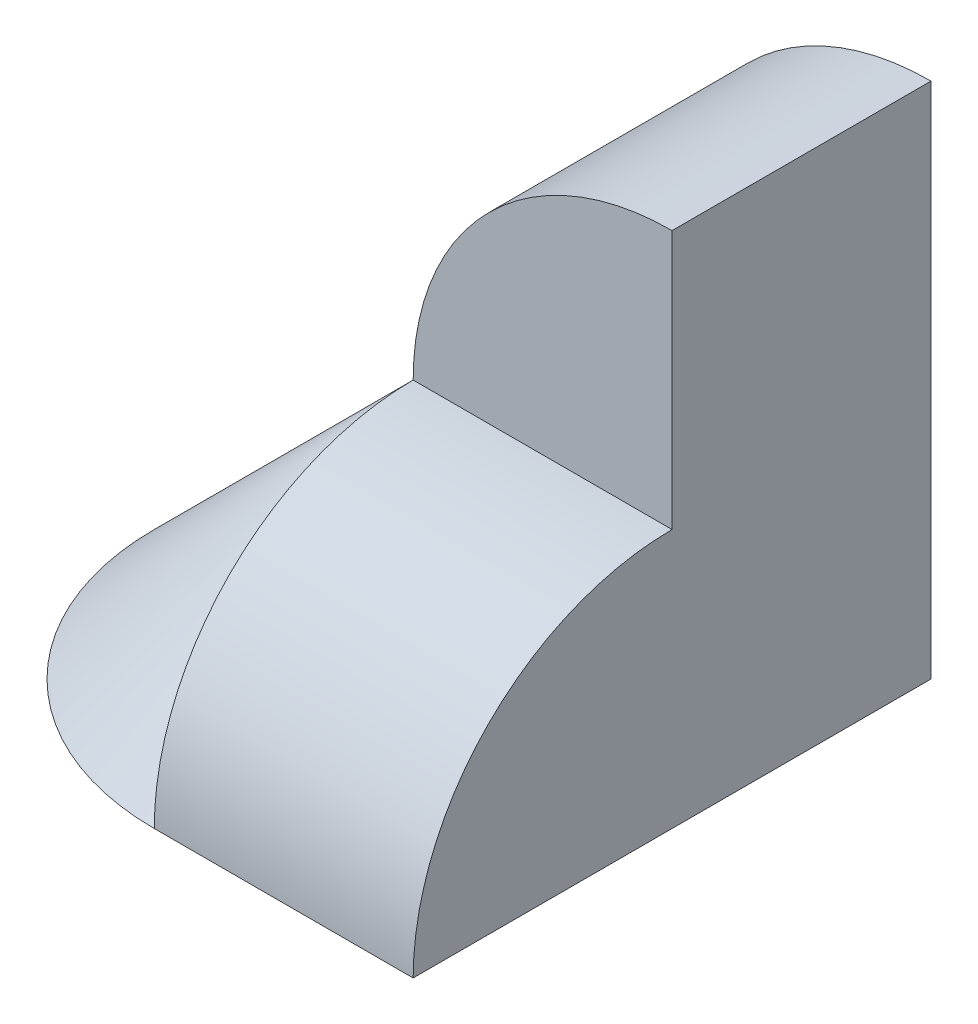
ISO-10303-21;
HEADER;
FILE_DESCRIPTION(('STEP AP214'),'2;1');
FILE_NAME('part.step','',(''),(''),'','','');
FILE_SCHEMA(('AUTOMOTIVE_DESIGN { 1 0 10303 214 1 1 1 1 }'));
ENDSEC;
DATA;
#1=APPLICATION_CONTEXT('core data for automotive mechanical design processes');
#2=APPLICATION_PROTOCOL_DEFINITION('international standard','automotive_design',2000,#1);
#3=PRODUCT_CONTEXT('',#1,'mechanical');
#4=PRODUCT('Part','Part','',(#3));
#5=PRODUCT_RELATED_PRODUCT_CATEGORY('part','',(#4));
#6=PRODUCT_DEFINITION_FORMATION('','',#4);
#7=PRODUCT_DEFINITION_CONTEXT('part definition',#1,'design');
#8=PRODUCT_DEFINITION('design','',#6,#7);
#9=PRODUCT_DEFINITION_SHAPE('','',#8);
#10=(LENGTH_UNIT() NAMED_UNIT(*) SI_UNIT(.MILLI.,.METRE.));
#11=(NAMED_UNIT(*) PLANE_ANGLE_UNIT() SI_UNIT($,.RADIAN.));
#12=(NAMED_UNIT(*) SI_UNIT($,.STERADIAN.) SOLID_ANGLE_UNIT());
#13=UNCERTAINTY_MEASURE_WITH_UNIT(LENGTH_MEASURE(1.E-05),#10,'distance_accuracy_value','');
#14=(GEOMETRIC_REPRESENTATION_CONTEXT(3) GLOBAL_UNCERTAINTY_ASSIGNED_CONTEXT((#13)) GLOBAL_UNIT_ASSIGNED_CONTEXT((#10,
#11,#12)) REPRESENTATION_CONTEXT('',''));
#15=CARTESIAN_POINT('',(0.,0.,0.));
#16=DIRECTION('',(0.,0.,1.));
#17=DIRECTION('',(1.,0.,0.));
#18=AXIS2_PLACEMENT_3D('',#15,#16,#17);
#19=CARTESIAN_POINT('',(0.,0.,2.));
#20=DIRECTION('',(1.,0.,0.));
#21=DIRECTION('',(0.,0.,-1.));
#22=AXIS2_PLACEMENT_3D('',#19,#20,#21);
#23=PLANE('',#22);
#24=DIRECTION('',(0.,0.707106781186548,-0.707106781186548));
#25=VECTOR('',#24,1.);
#26=CARTESIAN_POINT('',(0.,2.,2.));
#27=LINE('',#26,#25);
#28=CARTESIAN_POINT('',(0.,0.,4.));
#29=VERTEX_POINT('',#28);
#30=CARTESIAN_POINT('',(0.,2.,2.));
#31=VERTEX_POINT('',#30);
#32=EDGE_CURVE('E109',#29,#31,#27,.T.);
#33=ORIENTED_EDGE('',*,*,#32,.F.);
#34=CARTESIAN_POINT('',(0.,0.,1.99999999999999));
#35=DIRECTION('',(1.,0.,0.));
#36=DIRECTION('',(0.,0.,-1.));
#37=AXIS2_PLACEMENT_3D('',#34,#35,#36);
#38=CIRCLE('',#37,2.00000000000001);
#39=EDGE_CURVE('E116',#31,#29,#38,.T.);
#40=ORIENTED_EDGE('',*,*,#39,.F.);
#41=EDGE_LOOP('',(#33,#40));
#42=FACE_BOUND('',#41,.T.);
#43=ADVANCED_FACE('F33',(#42),#23,.F.);
#44=DIRECTION('',(0.,0.,-1.));
#45=VECTOR('',#44,1.);
#46=CARTESIAN_POINT('',(0.,0.,2.));
#47=LINE('',#46,#45);
#48=CARTESIAN_POINT('',(0.,0.,0.999999999999997));
#49=VERTEX_POINT('',#48);
#50=CARTESIAN_POINT('',(0.,0.,0.));
#51=VERTEX_POINT('',#50);
#52=EDGE_CURVE('E41',#49,#51,#47,.T.);
#53=ORIENTED_EDGE('',*,*,#52,.F.);
#54=DIRECTION('',(0.,-1.,0.));
#55=VECTOR('',#54,1.);
#56=CARTESIAN_POINT('',(0.,2.,1.));
#57=LINE('',#56,#55);
#58=CARTESIAN_POINT('',(0.,2.,1.));
#59=VERTEX_POINT('',#58);
#60=EDGE_CURVE('E51',#59,#49,#57,.T.);
#61=ORIENTED_EDGE('',*,*,#60,.F.);
#62=DIRECTION('',(0.,0.,1.));
#63=VECTOR('',#62,1.);
#64=CARTESIAN_POINT('',(0.,2.,-2.));
#65=LINE('',#64,#63);
#66=CARTESIAN_POINT('',(0.,2.,0.));
#67=VERTEX_POINT('',#66);
#68=EDGE_CURVE('E130',#67,#59,#65,.T.);
#69=ORIENTED_EDGE('',*,*,#68,.F.);
#70=DIRECTION('',(0.,-1.,0.));
#71=VECTOR('',#70,1.);
#72=CARTESIAN_POINT('',(0.,0.,0.));
#73=LINE('',#72,#71);
#74=EDGE_CURVE('E132',#67,#51,#73,.T.);
#75=ORIENTED_EDGE('',*,*,#74,.T.);
#76=EDGE_LOOP('',(#53,#61,#69,#75));
#77=FACE_BOUND('',#76,.T.);
#78=ADVANCED_FACE('F35',(#77),#23,.F.);
#79=CARTESIAN_POINT('',(0.,0.,2.));
#80=DIRECTION('',(0.,1.,0.));
#81=DIRECTION('',(0.,0.,1.));
#82=AXIS2_PLACEMENT_3D('',#79,#80,#81);
#83=PLANE('',#82);
#84=DIRECTION('',(-1.,0.,0.));
#85=VECTOR('',#84,1.);
#86=CARTESIAN_POINT('',(0.,0.,1.));
#87=LINE('',#86,#85);
#88=CARTESIAN_POINT('',(-2.,0.,0.999999999999993));
#89=VERTEX_POINT('',#88);
#90=EDGE_CURVE('E86',#49,#89,#87,.T.);
#91=ORIENTED_EDGE('',*,*,#90,.F.);
#92=ORIENTED_EDGE('',*,*,#52,.T.);
#93=DIRECTION('',(1.,0.,0.));
#94=VECTOR('',#93,1.);
#95=CARTESIAN_POINT('',(0.,0.,0.));
#96=LINE('',#95,#94);
#97=CARTESIAN_POINT('',(2.,0.,0.));
#98=VERTEX_POINT('',#97);
#99=EDGE_CURVE('E138',#51,#98,#96,.T.);
#100=ORIENTED_EDGE('',*,*,#99,.T.);
#101=DIRECTION('',(0.,0.,-1.));
#102=VECTOR('',#101,1.);
#103=CARTESIAN_POINT('',(2.,0.,2.));
#104=LINE('',#103,#102);
#105=CARTESIAN_POINT('',(2.,0.,4.));
#106=VERTEX_POINT('',#105);
#107=EDGE_CURVE('E143',#106,#98,#104,.T.);
#108=ORIENTED_EDGE('',*,*,#107,.F.);
#109=DIRECTION('',(1.,0.,0.));
#110=VECTOR('',#109,1.);
#111=CARTESIAN_POINT('',(0.,0.,4.));
#112=LINE('',#111,#110);
#113=EDGE_CURVE('E119',#29,#106,#112,.T.);
#114=ORIENTED_EDGE('',*,*,#113,.F.);
#115=CARTESIAN_POINT('',(0.,0.,2.));
#116=DIRECTION('',(0.,1.,0.));
#117=DIRECTION('',(0.,0.,1.));
#118=AXIS2_PLACEMENT_3D('',#115,#116,#117);
#119=CIRCLE('',#118,2.);
#120=CARTESIAN_POINT('',(-2.,0.,1.99999999999999));
#121=VERTEX_POINT('',#120);
#122=EDGE_CURVE('E99',#121,#29,#119,.T.);
#123=ORIENTED_EDGE('',*,*,#122,.F.);
#124=DIRECTION('',(0.,0.,1.));
#125=VECTOR('',#124,1.);
#126=CARTESIAN_POINT('',(-2.,0.,0.999999999999993));
#127=LINE('',#126,#125);
#128=EDGE_CURVE('E93',#89,#121,#127,.T.);
#129=ORIENTED_EDGE('',*,*,#128,.F.);
#130=EDGE_LOOP('',(#91,#92,#100,#108,#114,#123,#129));
#131=FACE_BOUND('',#130,.T.);
#132=ADVANCED_FACE('F97',(#131),#83,.F.);
#133=CARTESIAN_POINT('',(2.,0.,2.));
#134=DIRECTION('',(-1.,0.,0.));
#135=DIRECTION('',(0.,0.,1.));
#136=AXIS2_PLACEMENT_3D('',#133,#134,#135);
#137=PLANE('',#136);
#138=DIRECTION('',(0.,1.,0.));
#139=VECTOR('',#138,1.);
#140=CARTESIAN_POINT('',(2.,0.,0.));
#141=LINE('',#140,#139);
#142=CARTESIAN_POINT('',(2.,4.,0.));
#143=VERTEX_POINT('',#142);
#144=EDGE_CURVE('E136',#98,#143,#141,.T.);
#145=ORIENTED_EDGE('',*,*,#144,.T.);
#146=DIRECTION('',(0.,0.,-1.));
#147=VECTOR('',#146,1.);
#148=CARTESIAN_POINT('',(2.,4.,2.));
#149=LINE('',#148,#147);
#150=CARTESIAN_POINT('',(2.,4.,2.));
#151=VERTEX_POINT('',#150);
#152=EDGE_CURVE('E135',#151,#143,#149,.T.);
#153=ORIENTED_EDGE('',*,*,#152,.F.);
#154=DIRECTION('',(0.,1.,0.));
#155=VECTOR('',#154,1.);
#156=CARTESIAN_POINT('',(2.,0.,2.));
#157=LINE('',#156,#155);
#158=CARTESIAN_POINT('',(2.,2.,2.));
#159=VERTEX_POINT('',#158);
#160=EDGE_CURVE('E133',#159,#151,#157,.T.);
#161=ORIENTED_EDGE('',*,*,#160,.F.);
#162=CARTESIAN_POINT('',(2.,0.,1.99999999999999));
#163=DIRECTION('',(1.,0.,0.));
#164=DIRECTION('',(0.,0.,-1.));
#165=AXIS2_PLACEMENT_3D('',#162,#163,#164);
#166=CIRCLE('',#165,2.00000000000001);
#167=EDGE_CURVE('E115',#159,#106,#166,.T.);
#168=ORIENTED_EDGE('',*,*,#167,.T.);
#169=ORIENTED_EDGE('',*,*,#107,.T.);
#170=EDGE_LOOP('',(#145,#153,#161,#168,#169));
#171=FACE_BOUND('',#170,.T.);
#172=ADVANCED_FACE('F153',(#171),#137,.F.);
#173=CARTESIAN_POINT('',(0.,0.,2.));
#174=DIRECTION('',(0.,0.,-1.));
#175=DIRECTION('',(-1.,0.,0.));
#176=AXIS2_PLACEMENT_3D('',#173,#174,#175);
#177=PLANE('',#176);
#178=CARTESIAN_POINT('',(2.,2.,2.));
#179=DIRECTION('',(0.,0.,-1.));
#180=DIRECTION('',(-1.,0.,0.));
#181=AXIS2_PLACEMENT_3D('',#178,#179,#180);
#182=CIRCLE('',#181,2.);
#183=EDGE_CURVE('E125',#31,#151,#182,.T.);
#184=ORIENTED_EDGE('',*,*,#183,.F.);
#185=DIRECTION('',(1.,0.,0.));
#186=VECTOR('',#185,1.);
#187=CARTESIAN_POINT('',(0.,2.,2.));
#188=LINE('',#187,#186);
#189=EDGE_CURVE('E122',#31,#159,#188,.T.);
#190=ORIENTED_EDGE('',*,*,#189,.T.);
#191=ORIENTED_EDGE('',*,*,#160,.T.);
#192=EDGE_LOOP('',(#184,#190,#191));
#193=FACE_BOUND('',#192,.T.);
#194=ADVANCED_FACE('F163',(#193),#177,.F.);
#195=CARTESIAN_POINT('',(0.,0.,0.));
#196=DIRECTION('',(0.,0.,-1.));
#197=DIRECTION('',(-1.,0.,0.));
#198=AXIS2_PLACEMENT_3D('',#195,#196,#197);
#199=PLANE('',#198);
#200=CARTESIAN_POINT('',(2.,2.,0.));
#201=DIRECTION('',(0.,0.,-1.));
#202=DIRECTION('',(-1.,0.,0.));
#203=AXIS2_PLACEMENT_3D('',#200,#201,#202);
#204=CIRCLE('',#203,2.);
#205=EDGE_CURVE('E11',#143,#67,#204,.F.);
#206=ORIENTED_EDGE('',*,*,#205,.F.);
#207=ORIENTED_EDGE('',*,*,#144,.F.);
#208=ORIENTED_EDGE('',*,*,#99,.F.);
#209=ORIENTED_EDGE('',*,*,#74,.F.);
#210=EDGE_LOOP('',(#206,#207,#208,#209));
#211=FACE_BOUND('',#210,.T.);
#212=ADVANCED_FACE('F150',(#211),#199,.T.);
#213=CARTESIAN_POINT('',(2.,2.,-2.));
#214=DIRECTION('',(0.,0.,1.));
#215=DIRECTION('',(1.,0.,0.));
#216=AXIS2_PLACEMENT_3D('',#213,#214,#215);
#217=CYLINDRICAL_SURFACE('',#216,2.);
#218=ORIENTED_EDGE('',*,*,#205,.T.);
#219=ORIENTED_EDGE('',*,*,#68,.T.);
#220=DIRECTION('',(0.,0.,1.));
#221=VECTOR('',#220,1.);
#222=CARTESIAN_POINT('',(0.,2.,1.));
#223=LINE('',#222,#221);
#224=EDGE_CURVE('E102',#59,#31,#223,.T.);
#225=ORIENTED_EDGE('',*,*,#224,.T.);
#226=ORIENTED_EDGE('',*,*,#183,.T.);
#227=ORIENTED_EDGE('',*,*,#152,.T.);
#228=EDGE_LOOP('',(#218,#219,#225,#226,#227));
#229=FACE_BOUND('',#228,.T.);
#230=ADVANCED_FACE('F174',(#229),#217,.T.);
#231=CARTESIAN_POINT('',(0.,0.,1.99999999999999));
#232=DIRECTION('',(1.,0.,0.));
#233=DIRECTION('',(0.,0.,-1.));
#234=AXIS2_PLACEMENT_3D('',#231,#232,#233);
#235=CYLINDRICAL_SURFACE('',#234,2.00000000000001);
#236=ORIENTED_EDGE('',*,*,#167,.F.);
#237=ORIENTED_EDGE('',*,*,#189,.F.);
#238=ORIENTED_EDGE('',*,*,#39,.T.);
#239=ORIENTED_EDGE('',*,*,#113,.T.);
#240=EDGE_LOOP('',(#236,#237,#238,#239));
#241=FACE_BOUND('',#240,.T.);
#242=ADVANCED_FACE('F156',(#241),#235,.T.);
#243=CARTESIAN_POINT('',(0.,0.,2.));
#244=DIRECTION('',(0.,-1.,0.));
#245=DIRECTION('',(0.,0.,-1.));
#246=AXIS2_PLACEMENT_3D('',#243,#244,#245);
#247=CONICAL_SURFACE('',#246,2.,0.785398163397448);
#248=DIRECTION('',(0.707106781186548,0.707106781186548,0.));
#249=VECTOR('',#248,1.);
#250=CARTESIAN_POINT('',(0.,2.,2.));
#251=LINE('',#250,#249);
#252=EDGE_CURVE('E112',#121,#31,#251,.T.);
#253=ORIENTED_EDGE('',*,*,#252,.F.);
#254=ORIENTED_EDGE('',*,*,#122,.T.);
#255=ORIENTED_EDGE('',*,*,#32,.T.);
#256=EDGE_LOOP('',(#253,#254,#255));
#257=FACE_BOUND('',#256,.T.);
#258=ADVANCED_FACE('F166',(#257),#247,.T.);
#259=CARTESIAN_POINT('',(-2.,0.,0.999999999999993));
#260=DIRECTION('',(0.707106781186547,-0.707106781186547,0.));
#261=DIRECTION('',(0.707106781186548,0.707106781186548,0.));
#262=AXIS2_PLACEMENT_3D('',#259,#260,#261);
#263=PLANE('',#262);
#264=ORIENTED_EDGE('',*,*,#252,.T.);
#265=ORIENTED_EDGE('',*,*,#224,.F.);
#266=DIRECTION('',(0.707106781186548,0.707106781186548,0.));
#267=VECTOR('',#266,1.);
#268=CARTESIAN_POINT('',(-2.,0.,0.999999999999993));
#269=LINE('',#268,#267);
#270=EDGE_CURVE('E90',#89,#59,#269,.T.);
#271=ORIENTED_EDGE('',*,*,#270,.F.);
#272=ORIENTED_EDGE('',*,*,#128,.T.);
#273=EDGE_LOOP('',(#264,#265,#271,#272));
#274=FACE_BOUND('',#273,.T.);
#275=ADVANCED_FACE('F104',(#274),#263,.F.);
#276=CARTESIAN_POINT('',(0.,0.,1.));
#277=DIRECTION('',(0.,0.,-1.));
#278=DIRECTION('',(-1.,0.,0.));
#279=AXIS2_PLACEMENT_3D('',#276,#277,#278);
#280=PLANE('',#279);
#281=ORIENTED_EDGE('',*,*,#270,.T.);
#282=ORIENTED_EDGE('',*,*,#60,.T.);
#283=ORIENTED_EDGE('',*,*,#90,.T.);
#284=EDGE_LOOP('',(#281,#282,#283));
#285=FACE_BOUND('',#284,.T.);
#286=ADVANCED_FACE('F88',(#285),#280,.T.);
#287=CLOSED_SHELL('',(#43,#78,#132,#172,#194,#212,#230,#242,#258,#275,#286));
#288=MANIFOLD_SOLID_BREP('B2',#287);
#289=ADVANCED_BREP_SHAPE_REPRESENTATION('',(#18,#288),#14);
#290=SHAPE_DEFINITION_REPRESENTATION(#9,#289);
ENDSEC;
END-ISO-10303-21;
